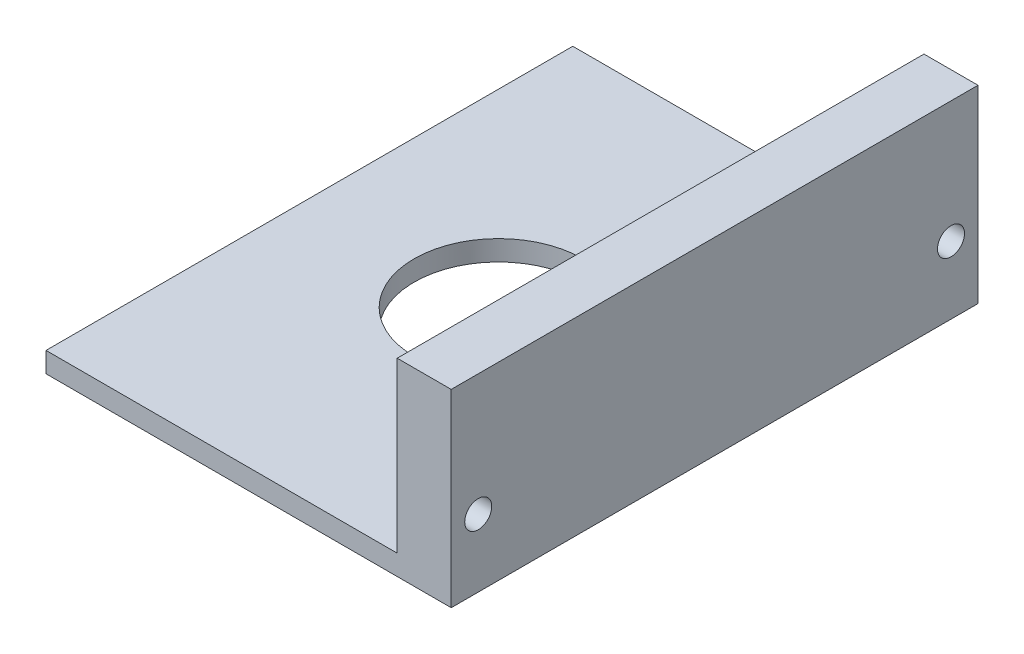
ISO-10303-21;
HEADER;
FILE_DESCRIPTION(('STEP AP214'),'2;1');
FILE_NAME('part.step','',(''),(''),'','','');
FILE_SCHEMA(('AUTOMOTIVE_DESIGN { 1 0 10303 214 1 1 1 1 }'));
ENDSEC;
DATA;
#1=APPLICATION_CONTEXT('core data for automotive mechanical design processes');
#2=APPLICATION_PROTOCOL_DEFINITION('international standard','automotive_design',2000,#1);
#3=PRODUCT_CONTEXT('',#1,'mechanical');
#4=PRODUCT('Part','Part','',(#3));
#5=PRODUCT_RELATED_PRODUCT_CATEGORY('part','',(#4));
#6=PRODUCT_DEFINITION_FORMATION('','',#4);
#7=PRODUCT_DEFINITION_CONTEXT('part definition',#1,'design');
#8=PRODUCT_DEFINITION('design','',#6,#7);
#9=PRODUCT_DEFINITION_SHAPE('','',#8);
#10=(LENGTH_UNIT() NAMED_UNIT(*) SI_UNIT(.MILLI.,.METRE.));
#11=(NAMED_UNIT(*) PLANE_ANGLE_UNIT() SI_UNIT($,.RADIAN.));
#12=(NAMED_UNIT(*) SI_UNIT($,.STERADIAN.) SOLID_ANGLE_UNIT());
#13=UNCERTAINTY_MEASURE_WITH_UNIT(LENGTH_MEASURE(1.E-05),#10,'distance_accuracy_value','');
#14=(GEOMETRIC_REPRESENTATION_CONTEXT(3) GLOBAL_UNCERTAINTY_ASSIGNED_CONTEXT((#13)) GLOBAL_UNIT_ASSIGNED_CONTEXT((#10,
#11,#12)) REPRESENTATION_CONTEXT('',''));
#15=CARTESIAN_POINT('',(0.,0.,0.));
#16=DIRECTION('',(0.,0.,1.));
#17=DIRECTION('',(1.,0.,0.));
#18=AXIS2_PLACEMENT_3D('',#15,#16,#17);
#19=CARTESIAN_POINT('',(30.,3.,-38.9999999999999));
#20=DIRECTION('',(-1.,0.,0.));
#21=DIRECTION('',(0.,0.,1.));
#22=AXIS2_PLACEMENT_3D('',#19,#20,#21);
#23=PLANE('',#22);
#24=CARTESIAN_POINT('',(30.,10.,-34.9999999999999));
#25=DIRECTION('',(-1.,0.,0.));
#26=DIRECTION('',(0.,0.,1.));
#27=AXIS2_PLACEMENT_3D('',#24,#25,#26);
#28=CIRCLE('',#27,2.);
#29=CARTESIAN_POINT('',(30.,10.,-32.9999999999999));
#30=VERTEX_POINT('',#29);
#31=EDGE_CURVE('E192',#30,#30,#28,.T.);
#32=ORIENTED_EDGE('',*,*,#31,.T.);
#33=EDGE_LOOP('',(#32));
#34=FACE_BOUND('',#33,.T.);
#35=CARTESIAN_POINT('',(30.,10.,35.0000000000002));
#36=DIRECTION('',(-1.,0.,0.));
#37=DIRECTION('',(0.,0.,1.));
#38=AXIS2_PLACEMENT_3D('',#35,#36,#37);
#39=CIRCLE('',#38,2.);
#40=CARTESIAN_POINT('',(30.,10.,37.0000000000002));
#41=VERTEX_POINT('',#40);
#42=EDGE_CURVE('E154',#41,#41,#39,.T.);
#43=ORIENTED_EDGE('',*,*,#42,.T.);
#44=EDGE_LOOP('',(#43));
#45=FACE_BOUND('',#44,.T.);
#46=DIRECTION('',(0.,0.,-1.));
#47=VECTOR('',#46,1.);
#48=CARTESIAN_POINT('',(30.,0.,-38.9999999999999));
#49=LINE('',#48,#47);
#50=CARTESIAN_POINT('',(30.,0.,39.0000000000002));
#51=VERTEX_POINT('',#50);
#52=CARTESIAN_POINT('',(30.,0.,-38.9999999999999));
#53=VERTEX_POINT('',#52);
#54=EDGE_CURVE('E99',#51,#53,#49,.T.);
#55=ORIENTED_EDGE('',*,*,#54,.T.);
#56=DIRECTION('',(0.,-1.,0.));
#57=VECTOR('',#56,1.);
#58=CARTESIAN_POINT('',(30.,3.,-38.9999999999999));
#59=LINE('',#58,#57);
#60=CARTESIAN_POINT('',(30.,28.,-38.9999999999999));
#61=VERTEX_POINT('',#60);
#62=EDGE_CURVE('E11',#61,#53,#59,.T.);
#63=ORIENTED_EDGE('',*,*,#62,.F.);
#64=DIRECTION('',(0.,0.,-1.));
#65=VECTOR('',#64,1.);
#66=CARTESIAN_POINT('',(30.,28.,39.0000000000002));
#67=LINE('',#66,#65);
#68=CARTESIAN_POINT('',(30.,28.,39.0000000000002));
#69=VERTEX_POINT('',#68);
#70=EDGE_CURVE('E101',#69,#61,#67,.T.);
#71=ORIENTED_EDGE('',*,*,#70,.F.);
#72=DIRECTION('',(0.,-1.,0.));
#73=VECTOR('',#72,1.);
#74=CARTESIAN_POINT('',(30.,3.,39.0000000000002));
#75=LINE('',#74,#73);
#76=EDGE_CURVE('E85',#69,#51,#75,.T.);
#77=ORIENTED_EDGE('',*,*,#76,.T.);
#78=EDGE_LOOP('',(#55,#63,#71,#77));
#79=FACE_BOUND('',#78,.T.);
#80=ADVANCED_FACE('F39',(#34,#45,#79),#23,.F.);
#81=CARTESIAN_POINT('',(-30.,3.,-38.9999999999999));
#82=DIRECTION('',(0.,0.,1.));
#83=DIRECTION('',(1.,0.,0.));
#84=AXIS2_PLACEMENT_3D('',#81,#82,#83);
#85=PLANE('',#84);
#86=DIRECTION('',(-1.,0.,0.));
#87=VECTOR('',#86,1.);
#88=CARTESIAN_POINT('',(-30.,0.,-38.9999999999999));
#89=LINE('',#88,#87);
#90=CARTESIAN_POINT('',(-30.,0.,-38.9999999999999));
#91=VERTEX_POINT('',#90);
#92=EDGE_CURVE('E107',#53,#91,#89,.T.);
#93=ORIENTED_EDGE('',*,*,#92,.T.);
#94=DIRECTION('',(0.,-1.,0.));
#95=VECTOR('',#94,1.);
#96=CARTESIAN_POINT('',(-30.,3.,-38.9999999999999));
#97=LINE('',#96,#95);
#98=CARTESIAN_POINT('',(-30.,3.,-38.9999999999999));
#99=VERTEX_POINT('',#98);
#100=EDGE_CURVE('E47',#99,#91,#97,.T.);
#101=ORIENTED_EDGE('',*,*,#100,.F.);
#102=DIRECTION('',(-1.,0.,0.));
#103=VECTOR('',#102,1.);
#104=CARTESIAN_POINT('',(-30.,3.,-38.9999999999999));
#105=LINE('',#104,#103);
#106=CARTESIAN_POINT('',(22.,3.,-38.9999999999999));
#107=VERTEX_POINT('',#106);
#108=EDGE_CURVE('E93',#107,#99,#105,.T.);
#109=ORIENTED_EDGE('',*,*,#108,.F.);
#110=DIRECTION('',(0.,-1.,0.));
#111=VECTOR('',#110,1.);
#112=CARTESIAN_POINT('',(22.,28.,-38.9999999999999));
#113=LINE('',#112,#111);
#114=CARTESIAN_POINT('',(22.,28.,-38.9999999999999));
#115=VERTEX_POINT('',#114);
#116=EDGE_CURVE('E109',#115,#107,#113,.T.);
#117=ORIENTED_EDGE('',*,*,#116,.F.);
#118=DIRECTION('',(-1.,0.,0.));
#119=VECTOR('',#118,1.);
#120=CARTESIAN_POINT('',(30.,28.,-38.9999999999999));
#121=LINE('',#120,#119);
#122=EDGE_CURVE('E134',#61,#115,#121,.T.);
#123=ORIENTED_EDGE('',*,*,#122,.F.);
#124=ORIENTED_EDGE('',*,*,#62,.T.);
#125=EDGE_LOOP('',(#93,#101,#109,#117,#123,#124));
#126=FACE_BOUND('',#125,.T.);
#127=ADVANCED_FACE('F129',(#126),#85,.F.);
#128=CARTESIAN_POINT('',(-30.,3.,-38.9999999999999));
#129=DIRECTION('',(1.,0.,0.));
#130=DIRECTION('',(0.,0.,-1.));
#131=AXIS2_PLACEMENT_3D('',#128,#129,#130);
#132=PLANE('',#131);
#133=DIRECTION('',(0.,0.,1.));
#134=VECTOR('',#133,1.);
#135=CARTESIAN_POINT('',(-30.,0.,-38.9999999999999));
#136=LINE('',#135,#134);
#137=CARTESIAN_POINT('',(-30.,0.,39.0000000000002));
#138=VERTEX_POINT('',#137);
#139=EDGE_CURVE('E94',#91,#138,#136,.T.);
#140=ORIENTED_EDGE('',*,*,#139,.T.);
#141=DIRECTION('',(0.,-1.,0.));
#142=VECTOR('',#141,1.);
#143=CARTESIAN_POINT('',(-30.,3.,39.0000000000002));
#144=LINE('',#143,#142);
#145=CARTESIAN_POINT('',(-30.,3.,39.0000000000002));
#146=VERTEX_POINT('',#145);
#147=EDGE_CURVE('E88',#146,#138,#144,.T.);
#148=ORIENTED_EDGE('',*,*,#147,.F.);
#149=DIRECTION('',(0.,0.,1.));
#150=VECTOR('',#149,1.);
#151=CARTESIAN_POINT('',(-30.,3.,-38.9999999999999));
#152=LINE('',#151,#150);
#153=EDGE_CURVE('E60',#99,#146,#152,.T.);
#154=ORIENTED_EDGE('',*,*,#153,.F.);
#155=ORIENTED_EDGE('',*,*,#100,.T.);
#156=EDGE_LOOP('',(#140,#148,#154,#155));
#157=FACE_BOUND('',#156,.T.);
#158=ADVANCED_FACE('F127',(#157),#132,.F.);
#159=CARTESIAN_POINT('',(-30.,3.,39.0000000000002));
#160=DIRECTION('',(0.,0.,-1.));
#161=DIRECTION('',(-1.,0.,0.));
#162=AXIS2_PLACEMENT_3D('',#159,#160,#161);
#163=PLANE('',#162);
#164=DIRECTION('',(1.,0.,0.));
#165=VECTOR('',#164,1.);
#166=CARTESIAN_POINT('',(-30.,0.,39.0000000000002));
#167=LINE('',#166,#165);
#168=EDGE_CURVE('E80',#138,#51,#167,.T.);
#169=ORIENTED_EDGE('',*,*,#168,.T.);
#170=ORIENTED_EDGE('',*,*,#76,.F.);
#171=DIRECTION('',(1.,0.,0.));
#172=VECTOR('',#171,1.);
#173=CARTESIAN_POINT('',(22.,28.,39.0000000000002));
#174=LINE('',#173,#172);
#175=CARTESIAN_POINT('',(22.,28.,39.0000000000002));
#176=VERTEX_POINT('',#175);
#177=EDGE_CURVE('E140',#176,#69,#174,.T.);
#178=ORIENTED_EDGE('',*,*,#177,.F.);
#179=DIRECTION('',(0.,-1.,0.));
#180=VECTOR('',#179,1.);
#181=CARTESIAN_POINT('',(22.,28.,39.0000000000002));
#182=LINE('',#181,#180);
#183=CARTESIAN_POINT('',(22.,3.,39.0000000000002));
#184=VERTEX_POINT('',#183);
#185=EDGE_CURVE('E115',#176,#184,#182,.T.);
#186=ORIENTED_EDGE('',*,*,#185,.T.);
#187=DIRECTION('',(1.,0.,0.));
#188=VECTOR('',#187,1.);
#189=CARTESIAN_POINT('',(-30.,3.,39.0000000000002));
#190=LINE('',#189,#188);
#191=EDGE_CURVE('E104',#146,#184,#190,.T.);
#192=ORIENTED_EDGE('',*,*,#191,.F.);
#193=ORIENTED_EDGE('',*,*,#147,.T.);
#194=EDGE_LOOP('',(#169,#170,#178,#186,#192,#193));
#195=FACE_BOUND('',#194,.T.);
#196=ADVANCED_FACE('F82',(#195),#163,.F.);
#197=CARTESIAN_POINT('',(0.,3.,0.));
#198=DIRECTION('',(0.,1.,0.));
#199=DIRECTION('',(0.,0.,1.));
#200=AXIS2_PLACEMENT_3D('',#197,#198,#199);
#201=PLANE('',#200);
#202=CARTESIAN_POINT('',(-2.00000000000003,3.,0.));
#203=DIRECTION('',(0.,1.,0.));
#204=DIRECTION('',(0.,0.,1.));
#205=AXIS2_PLACEMENT_3D('',#202,#203,#204);
#206=CIRCLE('',#205,12.5);
#207=CARTESIAN_POINT('',(-2.00000000000003,3.,12.5));
#208=VERTEX_POINT('',#207);
#209=EDGE_CURVE('E208',#208,#208,#206,.T.);
#210=ORIENTED_EDGE('',*,*,#209,.F.);
#211=EDGE_LOOP('',(#210));
#212=FACE_BOUND('',#211,.T.);
#213=DIRECTION('',(0.,0.,1.));
#214=VECTOR('',#213,1.);
#215=CARTESIAN_POINT('',(22.,3.,39.0000000000002));
#216=LINE('',#215,#214);
#217=EDGE_CURVE('E54',#107,#184,#216,.T.);
#218=ORIENTED_EDGE('',*,*,#217,.F.);
#219=ORIENTED_EDGE('',*,*,#108,.T.);
#220=ORIENTED_EDGE('',*,*,#153,.T.);
#221=ORIENTED_EDGE('',*,*,#191,.T.);
#222=EDGE_LOOP('',(#218,#219,#220,#221));
#223=FACE_BOUND('',#222,.T.);
#224=ADVANCED_FACE('F162',(#212,#223),#201,.T.);
#225=CARTESIAN_POINT('',(0.,0.,0.));
#226=DIRECTION('',(0.,1.,0.));
#227=DIRECTION('',(0.,0.,1.));
#228=AXIS2_PLACEMENT_3D('',#225,#226,#227);
#229=PLANE('',#228);
#230=CARTESIAN_POINT('',(-2.00000000000003,0.,0.));
#231=DIRECTION('',(0.,-1.,0.));
#232=DIRECTION('',(0.,0.,-1.));
#233=AXIS2_PLACEMENT_3D('',#230,#231,#232);
#234=CIRCLE('',#233,12.5);
#235=CARTESIAN_POINT('',(-2.00000000000003,0.,-12.5));
#236=VERTEX_POINT('',#235);
#237=EDGE_CURVE('E212',#236,#236,#234,.T.);
#238=ORIENTED_EDGE('',*,*,#237,.F.);
#239=EDGE_LOOP('',(#238));
#240=FACE_BOUND('',#239,.T.);
#241=ORIENTED_EDGE('',*,*,#54,.F.);
#242=ORIENTED_EDGE('',*,*,#168,.F.);
#243=ORIENTED_EDGE('',*,*,#139,.F.);
#244=ORIENTED_EDGE('',*,*,#92,.F.);
#245=EDGE_LOOP('',(#241,#242,#243,#244));
#246=FACE_BOUND('',#245,.T.);
#247=ADVANCED_FACE('F106',(#240,#246),#229,.F.);
#248=CARTESIAN_POINT('',(22.,28.,39.0000000000002));
#249=DIRECTION('',(1.,0.,0.));
#250=DIRECTION('',(0.,0.,-1.));
#251=AXIS2_PLACEMENT_3D('',#248,#249,#250);
#252=PLANE('',#251);
#253=CARTESIAN_POINT('',(22.,10.,-34.9999999999999));
#254=DIRECTION('',(-1.,0.,0.));
#255=DIRECTION('',(0.,0.,1.));
#256=AXIS2_PLACEMENT_3D('',#253,#254,#255);
#257=CIRCLE('',#256,2.);
#258=CARTESIAN_POINT('',(22.,10.,-32.9999999999999));
#259=VERTEX_POINT('',#258);
#260=EDGE_CURVE('E204',#259,#259,#257,.T.);
#261=ORIENTED_EDGE('',*,*,#260,.F.);
#262=EDGE_LOOP('',(#261));
#263=FACE_BOUND('',#262,.T.);
#264=CARTESIAN_POINT('',(22.,10.,35.0000000000002));
#265=DIRECTION('',(-1.,0.,0.));
#266=DIRECTION('',(0.,0.,1.));
#267=AXIS2_PLACEMENT_3D('',#264,#265,#266);
#268=CIRCLE('',#267,2.);
#269=CARTESIAN_POINT('',(22.,10.,37.0000000000002));
#270=VERTEX_POINT('',#269);
#271=EDGE_CURVE('E197',#270,#270,#268,.T.);
#272=ORIENTED_EDGE('',*,*,#271,.F.);
#273=EDGE_LOOP('',(#272));
#274=FACE_BOUND('',#273,.T.);
#275=ORIENTED_EDGE('',*,*,#217,.T.);
#276=ORIENTED_EDGE('',*,*,#185,.F.);
#277=DIRECTION('',(0.,0.,1.));
#278=VECTOR('',#277,1.);
#279=CARTESIAN_POINT('',(22.,28.,39.0000000000002));
#280=LINE('',#279,#278);
#281=EDGE_CURVE('E145',#115,#176,#280,.T.);
#282=ORIENTED_EDGE('',*,*,#281,.F.);
#283=ORIENTED_EDGE('',*,*,#116,.T.);
#284=EDGE_LOOP('',(#275,#276,#282,#283));
#285=FACE_BOUND('',#284,.T.);
#286=ADVANCED_FACE('F165',(#263,#274,#285),#252,.F.);
#287=CARTESIAN_POINT('',(0.,28.,0.));
#288=DIRECTION('',(0.,1.,0.));
#289=DIRECTION('',(0.,0.,1.));
#290=AXIS2_PLACEMENT_3D('',#287,#288,#289);
#291=PLANE('',#290);
#292=ORIENTED_EDGE('',*,*,#177,.T.);
#293=ORIENTED_EDGE('',*,*,#70,.T.);
#294=ORIENTED_EDGE('',*,*,#122,.T.);
#295=ORIENTED_EDGE('',*,*,#281,.T.);
#296=EDGE_LOOP('',(#292,#293,#294,#295));
#297=FACE_BOUND('',#296,.T.);
#298=ADVANCED_FACE('F138',(#297),#291,.T.);
#299=CARTESIAN_POINT('',(52.,10.,35.0000000000002));
#300=DIRECTION('',(-1.,0.,0.));
#301=DIRECTION('',(0.,0.,1.));
#302=AXIS2_PLACEMENT_3D('',#299,#300,#301);
#303=CYLINDRICAL_SURFACE('',#302,2.);
#304=ORIENTED_EDGE('',*,*,#271,.T.);
#305=EDGE_LOOP('',(#304));
#306=FACE_BOUND('',#305,.T.);
#307=ORIENTED_EDGE('',*,*,#42,.F.);
#308=EDGE_LOOP('',(#307));
#309=FACE_BOUND('',#308,.T.);
#310=ADVANCED_FACE('F177',(#306,#309),#303,.F.);
#311=CARTESIAN_POINT('',(52.,10.,-34.9999999999999));
#312=DIRECTION('',(-1.,0.,0.));
#313=DIRECTION('',(0.,0.,1.));
#314=AXIS2_PLACEMENT_3D('',#311,#312,#313);
#315=CYLINDRICAL_SURFACE('',#314,2.);
#316=ORIENTED_EDGE('',*,*,#260,.T.);
#317=EDGE_LOOP('',(#316));
#318=FACE_BOUND('',#317,.T.);
#319=ORIENTED_EDGE('',*,*,#31,.F.);
#320=EDGE_LOOP('',(#319));
#321=FACE_BOUND('',#320,.T.);
#322=ADVANCED_FACE('F219',(#318,#321),#315,.F.);
#323=CARTESIAN_POINT('',(-2.00000000000003,28.,0.));
#324=DIRECTION('',(0.,-1.,0.));
#325=DIRECTION('',(0.,0.,-1.));
#326=AXIS2_PLACEMENT_3D('',#323,#324,#325);
#327=CYLINDRICAL_SURFACE('',#326,12.5);
#328=ORIENTED_EDGE('',*,*,#209,.T.);
#329=EDGE_LOOP('',(#328));
#330=FACE_BOUND('',#329,.T.);
#331=ORIENTED_EDGE('',*,*,#237,.T.);
#332=EDGE_LOOP('',(#331));
#333=FACE_BOUND('',#332,.T.);
#334=ADVANCED_FACE('F217',(#330,#333),#327,.F.);
#335=CLOSED_SHELL('',(#80,#127,#158,#196,#224,#247,#286,#298,#310,#322,#334));
#336=MANIFOLD_SOLID_BREP('B2',#335);
#337=ADVANCED_BREP_SHAPE_REPRESENTATION('',(#18,#336),#14);
#338=SHAPE_DEFINITION_REPRESENTATION(#9,#337);
ENDSEC;
END-ISO-10303-21;
